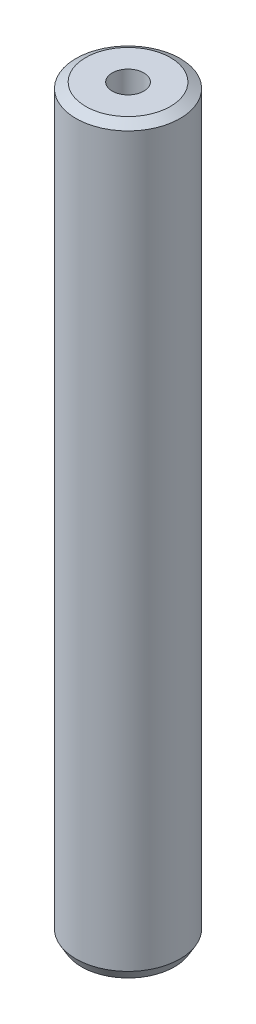
ISO-10303-21;
HEADER;
FILE_DESCRIPTION(('STEP AP214'),'2;1');
FILE_NAME('part.step','',(''),(''),'','','');
FILE_SCHEMA(('AUTOMOTIVE_DESIGN { 1 0 10303 214 1 1 1 1 }'));
ENDSEC;
DATA;
#1=APPLICATION_CONTEXT('core data for automotive mechanical design processes');
#2=APPLICATION_PROTOCOL_DEFINITION('international standard','automotive_design',2000,#1);
#3=PRODUCT_CONTEXT('',#1,'mechanical');
#4=PRODUCT('Part','Part','',(#3));
#5=PRODUCT_RELATED_PRODUCT_CATEGORY('part','',(#4));
#6=PRODUCT_DEFINITION_FORMATION('','',#4);
#7=PRODUCT_DEFINITION_CONTEXT('part definition',#1,'design');
#8=PRODUCT_DEFINITION('design','',#6,#7);
#9=PRODUCT_DEFINITION_SHAPE('','',#8);
#10=(LENGTH_UNIT() NAMED_UNIT(*) SI_UNIT(.MILLI.,.METRE.));
#11=(NAMED_UNIT(*) PLANE_ANGLE_UNIT() SI_UNIT($,.RADIAN.));
#12=(NAMED_UNIT(*) SI_UNIT($,.STERADIAN.) SOLID_ANGLE_UNIT());
#13=UNCERTAINTY_MEASURE_WITH_UNIT(LENGTH_MEASURE(1.E-05),#10,'distance_accuracy_value','');
#14=(GEOMETRIC_REPRESENTATION_CONTEXT(3) GLOBAL_UNCERTAINTY_ASSIGNED_CONTEXT((#13)) GLOBAL_UNIT_ASSIGNED_CONTEXT((#10,
#11,#12)) REPRESENTATION_CONTEXT('',''));
#15=CARTESIAN_POINT('',(0.,0.,0.));
#16=DIRECTION('',(0.,0.,1.));
#17=DIRECTION('',(1.,0.,0.));
#18=AXIS2_PLACEMENT_3D('',#15,#16,#17);
#19=CARTESIAN_POINT('',(0.,214.138295899525,0.));
#20=DIRECTION('',(0.,-1.,0.));
#21=DIRECTION('',(0.,0.,-1.));
#22=AXIS2_PLACEMENT_3D('',#19,#20,#21);
#23=CYLINDRICAL_SURFACE('',#22,15.);
#24=CARTESIAN_POINT('',(0.,212.524387314182,0.));
#25=DIRECTION('',(0.,1.,0.));
#26=DIRECTION('',(0.,0.,1.));
#27=AXIS2_PLACEMENT_3D('',#24,#25,#26);
#28=CIRCLE('',#27,15.);
#29=CARTESIAN_POINT('',(0.,212.524387314182,-15.));
#30=VERTEX_POINT('',#29);
#31=EDGE_CURVE('E50',#30,#30,#28,.F.);
#32=ORIENTED_EDGE('',*,*,#31,.T.);
#33=EDGE_LOOP('',(#32));
#34=FACE_BOUND('',#33,.T.);
#35=CARTESIAN_POINT('',(0.,2.79537166858676,0.));
#36=DIRECTION('',(0.,1.,0.));
#37=DIRECTION('',(0.,0.,1.));
#38=AXIS2_PLACEMENT_3D('',#35,#36,#37);
#39=CIRCLE('',#38,15.);
#40=CARTESIAN_POINT('',(0.,2.79537166858676,15.));
#41=VERTEX_POINT('',#40);
#42=EDGE_CURVE('E51',#41,#41,#39,.T.);
#43=ORIENTED_EDGE('',*,*,#42,.T.);
#44=EDGE_LOOP('',(#43));
#45=FACE_BOUND('',#44,.T.);
#46=ADVANCED_FACE('F39',(#34,#45),#23,.T.);
#47=CARTESIAN_POINT('',(0.,214.138295899525,0.));
#48=DIRECTION('',(0.,1.,0.));
#49=DIRECTION('',(0.,0.,1.));
#50=AXIS2_PLACEMENT_3D('',#47,#48,#49);
#51=PLANE('',#50);
#52=CARTESIAN_POINT('',(0.,214.138295899525,0.));
#53=DIRECTION('',(0.,1.,0.));
#54=DIRECTION('',(0.,0.,1.));
#55=AXIS2_PLACEMENT_3D('',#52,#53,#54);
#56=CIRCLE('',#55,12.2046283314132);
#57=CARTESIAN_POINT('',(0.,214.138295899525,-12.2046283314132));
#58=VERTEX_POINT('',#57);
#59=EDGE_CURVE('E54',#58,#58,#56,.T.);
#60=ORIENTED_EDGE('',*,*,#59,.T.);
#61=EDGE_LOOP('',(#60));
#62=FACE_BOUND('',#61,.T.);
#63=CARTESIAN_POINT('',(0.,214.138295899525,0.));
#64=DIRECTION('',(0.,1.,0.));
#65=DIRECTION('',(0.,0.,1.));
#66=AXIS2_PLACEMENT_3D('',#63,#64,#65);
#67=CIRCLE('',#66,4.56037486545979);
#68=CARTESIAN_POINT('',(0.,214.138295899525,4.56037486545979));
#69=VERTEX_POINT('',#68);
#70=EDGE_CURVE('E58',#69,#69,#67,.T.);
#71=ORIENTED_EDGE('',*,*,#70,.F.);
#72=EDGE_LOOP('',(#71));
#73=FACE_BOUND('',#72,.T.);
#74=ADVANCED_FACE('F69',(#62,#73),#51,.T.);
#75=CARTESIAN_POINT('',(0.,0.,0.));
#76=DIRECTION('',(0.,1.,0.));
#77=DIRECTION('',(0.,0.,1.));
#78=AXIS2_PLACEMENT_3D('',#75,#76,#77);
#79=PLANE('',#78);
#80=CARTESIAN_POINT('',(0.,0.,0.));
#81=DIRECTION('',(0.,1.,0.));
#82=DIRECTION('',(0.,0.,1.));
#83=AXIS2_PLACEMENT_3D('',#80,#81,#82);
#84=CIRCLE('',#83,13.3860914146564);
#85=CARTESIAN_POINT('',(0.,0.,13.3860914146564));
#86=VERTEX_POINT('',#85);
#87=EDGE_CURVE('E10',#86,#86,#84,.F.);
#88=ORIENTED_EDGE('',*,*,#87,.T.);
#89=EDGE_LOOP('',(#88));
#90=FACE_BOUND('',#89,.T.);
#91=CARTESIAN_POINT('',(0.,0.,0.));
#92=DIRECTION('',(0.,1.,0.));
#93=DIRECTION('',(0.,0.,1.));
#94=AXIS2_PLACEMENT_3D('',#91,#92,#93);
#95=CIRCLE('',#94,4.56037486545979);
#96=CARTESIAN_POINT('',(0.,0.,4.56037486545979));
#97=VERTEX_POINT('',#96);
#98=EDGE_CURVE('E63',#97,#97,#95,.T.);
#99=ORIENTED_EDGE('',*,*,#98,.T.);
#100=EDGE_LOOP('',(#99));
#101=FACE_BOUND('',#100,.T.);
#102=ADVANCED_FACE('F75',(#90,#101),#79,.F.);
#103=CARTESIAN_POINT('',(0.,214.138295899525,0.));
#104=DIRECTION('',(0.,-1.,0.));
#105=DIRECTION('',(0.,0.,-1.));
#106=AXIS2_PLACEMENT_3D('',#103,#104,#105);
#107=CYLINDRICAL_SURFACE('',#106,4.56037486545979);
#108=ORIENTED_EDGE('',*,*,#70,.T.);
#109=EDGE_LOOP('',(#108));
#110=FACE_BOUND('',#109,.T.);
#111=ORIENTED_EDGE('',*,*,#98,.F.);
#112=EDGE_LOOP('',(#111));
#113=FACE_BOUND('',#112,.T.);
#114=ADVANCED_FACE('F70',(#110,#113),#107,.F.);
#115=CARTESIAN_POINT('',(0.,214.138295899525,0.));
#116=DIRECTION('',(0.,-1.,0.));
#117=DIRECTION('',(0.,0.,-1.));
#118=AXIS2_PLACEMENT_3D('',#115,#116,#117);
#119=CONICAL_SURFACE('',#118,12.2046283314132,1.0471975511966);
#120=CARTESIAN_POINT('',(0.,212.524387314182,-15.));
#121=CARTESIAN_POINT('',(0.,212.541198861946,-14.9708815451189));
#122=CARTESIAN_POINT('',(0.,212.558010409709,-14.9417630902378));
#123=CARTESIAN_POINT('',(0.,212.591633505237,-14.8835261804756));
#124=CARTESIAN_POINT('',(0.,212.608445053001,-14.8544077255945));
#125=CARTESIAN_POINT('',(0.,212.642068148529,-14.7961708158322));
#126=CARTESIAN_POINT('',(0.,212.658879696293,-14.7670523609511));
#127=CARTESIAN_POINT('',(0.,212.692502791821,-14.7088154511889));
#128=CARTESIAN_POINT('',(0.,212.709314339585,-14.6796969963078));
#129=CARTESIAN_POINT('',(0.,212.742937435113,-14.6214600865456));
#130=CARTESIAN_POINT('',(0.,212.759748982877,-14.5923416316644));
#131=CARTESIAN_POINT('',(0.,212.793372078405,-14.5341047219022));
#132=CARTESIAN_POINT('',(0.,212.810183626169,-14.5049862670211));
#133=CARTESIAN_POINT('',(0.,212.843806721697,-14.4467493572589));
#134=CARTESIAN_POINT('',(0.,212.860618269461,-14.4176309023778));
#135=CARTESIAN_POINT('',(0.,212.894241364989,-14.3593939926155));
#136=CARTESIAN_POINT('',(0.,212.911052912753,-14.3302755377344));
#137=CARTESIAN_POINT('',(0.,212.944676008281,-14.2720386279722));
#138=CARTESIAN_POINT('',(0.,212.961487556045,-14.2429201730911));
#139=CARTESIAN_POINT('',(0.,212.995110651573,-14.1846832633289));
#140=CARTESIAN_POINT('',(0.,213.011922199337,-14.1555648084478));
#141=CARTESIAN_POINT('',(0.,213.045545294865,-14.0973278986855));
#142=CARTESIAN_POINT('',(0.,213.062356842629,-14.0682094438044));
#143=CARTESIAN_POINT('',(0.,213.095979938157,-14.0099725340422));
#144=CARTESIAN_POINT('',(0.,213.112791485921,-13.9808540791611));
#145=CARTESIAN_POINT('',(0.,213.146414581449,-13.9226171693988));
#146=CARTESIAN_POINT('',(0.,213.163226129213,-13.8934987145177));
#147=CARTESIAN_POINT('',(0.,213.196849224741,-13.8352618047555));
#148=CARTESIAN_POINT('',(0.,213.213660772505,-13.8061433498744));
#149=CARTESIAN_POINT('',(0.,213.247283868033,-13.7479064401122));
#150=CARTESIAN_POINT('',(0.,213.264095415797,-13.7187879852311));
#151=CARTESIAN_POINT('',(0.,213.297718511325,-13.6605510754688));
#152=CARTESIAN_POINT('',(0.,213.314530059089,-13.6314326205877));
#153=CARTESIAN_POINT('',(0.,213.348153154617,-13.5731957108255));
#154=CARTESIAN_POINT('',(0.,213.364964702381,-13.5440772559444));
#155=CARTESIAN_POINT('',(0.,213.398587797909,-13.4858403461822));
#156=CARTESIAN_POINT('',(0.,213.415399345673,-13.456721891301));
#157=CARTESIAN_POINT('',(0.,213.449022441201,-13.3984849815388));
#158=CARTESIAN_POINT('',(0.,213.465833988965,-13.3693665266577));
#159=CARTESIAN_POINT('',(0.,213.499457084493,-13.3111296168955));
#160=CARTESIAN_POINT('',(0.,213.516268632257,-13.2820111620144));
#161=CARTESIAN_POINT('',(0.,213.549891727785,-13.2237742522521));
#162=CARTESIAN_POINT('',(0.,213.566703275549,-13.194655797371));
#163=CARTESIAN_POINT('',(0.,213.600326371077,-13.1364188876088));
#164=CARTESIAN_POINT('',(0.,213.617137918841,-13.1073004327277));
#165=CARTESIAN_POINT('',(0.,213.650761014369,-13.0490635229655));
#166=CARTESIAN_POINT('',(0.,213.667572562133,-13.0199450680844));
#167=CARTESIAN_POINT('',(0.,213.701195657661,-12.9617081583221));
#168=CARTESIAN_POINT('',(0.,213.718007205425,-12.932589703441));
#169=CARTESIAN_POINT('',(0.,213.751630300953,-12.8743527936788));
#170=CARTESIAN_POINT('',(0.,213.768441848717,-12.8452343387977));
#171=CARTESIAN_POINT('',(0.,213.802064944245,-12.7869974290354));
#172=CARTESIAN_POINT('',(0.,213.818876492009,-12.7578789741543));
#173=CARTESIAN_POINT('',(0.,213.852499587537,-12.6996420643921));
#174=CARTESIAN_POINT('',(0.,213.869311135301,-12.670523609511));
#175=CARTESIAN_POINT('',(0.,213.902934230829,-12.6122866997488));
#176=CARTESIAN_POINT('',(0.,213.919745778593,-12.5831682448677));
#177=CARTESIAN_POINT('',(0.,213.953368874121,-12.5249313351054));
#178=CARTESIAN_POINT('',(0.,213.970180421885,-12.4958128802243));
#179=CARTESIAN_POINT('',(0.,214.003803517413,-12.4375759704621));
#180=CARTESIAN_POINT('',(0.,214.020615065177,-12.408457515581));
#181=CARTESIAN_POINT('',(0.,214.054238160705,-12.3502206058188));
#182=CARTESIAN_POINT('',(0.,214.071049708469,-12.3211021509376));
#183=CARTESIAN_POINT('',(0.,214.104672803997,-12.2628652411754));
#184=CARTESIAN_POINT('',(0.,214.121484351761,-12.2337467862943));
#185=CARTESIAN_POINT('',(0.,214.138295899525,-12.2046283314132));
#186=B_SPLINE_CURVE_WITH_KNOTS('',3,(#120,#121,#122,#123,#124,#125,#126,#127,#128,#129,#130,
#131,#132,#133,#134,#135,#136,#137,#138,#139,#140,#141,#142,#143,#144,#145,#146,#147,#148,#149,
#150,#151,#152,#153,#154,#155,#156,#157,#158,#159,#160,#161,#162,#163,#164,#165,#166,#167,#168,
#169,#170,#171,#172,#173,#174,#175,#176,#177,#178,#179,#180,#181,#182,#183,#184,#185),
.UNSPECIFIED.,.F.,.F.,(4,2,2,2,2,2,2,2,2,2,2,2,2,2,2,2,2,2,2,2,2,2,2,2,2,2,2,2,2,2,2,2,4),(0.,
0.100869286583966,0.201738573167946,0.302607859751926,0.403477146335904,0.504346432919884,
0.605215719503864,0.706085006087844,0.806954292671823,0.907823579255803,1.00869286583978,
1.10956215242376,1.21043143900774,1.31130072559172,1.4121700121757,1.51303929875968,
1.61390858534366,1.71477787192763,1.81564715851161,1.91651644509558,2.01738573167956,
2.11825501826354,2.21912430484752,2.3199935914315,2.42086287801548,2.52173216459946,
2.62260145118344,2.72347073776742,2.8243400243514,2.92520931093538,3.02607859751936,
3.12694788410334,3.22781717068732),.UNSPECIFIED.);
#187=EDGE_CURVE('BSEAM81',#30,#58,#186,.T.);
#188=ORIENTED_EDGE('',*,*,#31,.F.);
#189=ORIENTED_EDGE('',*,*,#59,.F.);
#190=ORIENTED_EDGE('',*,*,#187,.T.);
#191=ORIENTED_EDGE('',*,*,#187,.F.);
#192=EDGE_LOOP('',(#188,#190,#189,#191));
#193=FACE_BOUND('',#192,.T.);
#194=ADVANCED_FACE('F81',(#193),#119,.T.);
#195=CARTESIAN_POINT('',(0.,2.79537166858676,0.));
#196=DIRECTION('',(0.,1.,0.));
#197=DIRECTION('',(0.,0.,1.));
#198=AXIS2_PLACEMENT_3D('',#195,#196,#197);
#199=CONICAL_SURFACE('',#198,15.,0.523598775598298);
#200=ORIENTED_EDGE('',*,*,#87,.F.);
#201=EDGE_LOOP('',(#200));
#202=FACE_BOUND('',#201,.T.);
#203=ORIENTED_EDGE('',*,*,#42,.F.);
#204=EDGE_LOOP('',(#203));
#205=FACE_BOUND('',#204,.T.);
#206=ADVANCED_FACE('F45',(#202,#205),#199,.T.);
#207=CLOSED_SHELL('',(#46,#74,#102,#114,#194,#206));
#208=MANIFOLD_SOLID_BREP('B2',#207);
#209=ADVANCED_BREP_SHAPE_REPRESENTATION('',(#18,#208),#14);
#210=SHAPE_DEFINITION_REPRESENTATION(#9,#209);
ENDSEC;
END-ISO-10303-21;
